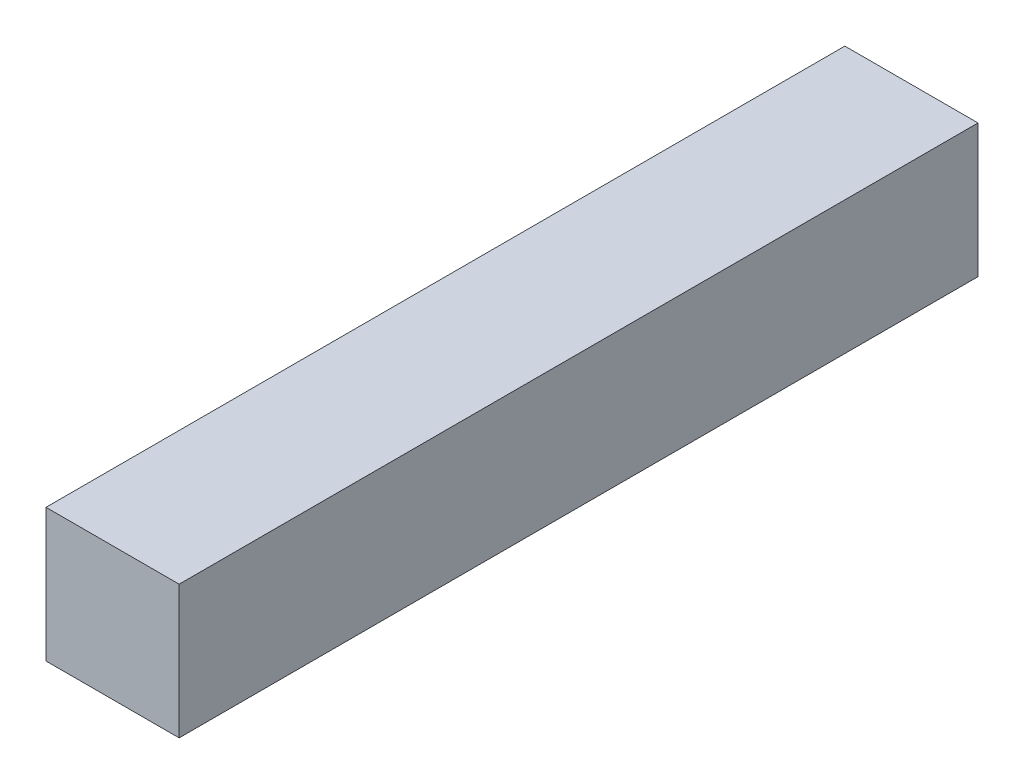
ISO-10303-21;
HEADER;
FILE_DESCRIPTION(('STEP AP214'),'2;1');
FILE_NAME('part.step','',(''),(''),'','','');
FILE_SCHEMA(('AUTOMOTIVE_DESIGN { 1 0 10303 214 1 1 1 1 }'));
ENDSEC;
DATA;
#1=APPLICATION_CONTEXT('core data for automotive mechanical design processes');
#2=APPLICATION_PROTOCOL_DEFINITION('international standard','automotive_design',2000,#1);
#3=PRODUCT_CONTEXT('',#1,'mechanical');
#4=PRODUCT('Part','Part','',(#3));
#5=PRODUCT_RELATED_PRODUCT_CATEGORY('part','',(#4));
#6=PRODUCT_DEFINITION_FORMATION('','',#4);
#7=PRODUCT_DEFINITION_CONTEXT('part definition',#1,'design');
#8=PRODUCT_DEFINITION('design','',#6,#7);
#9=PRODUCT_DEFINITION_SHAPE('','',#8);
#10=(LENGTH_UNIT() NAMED_UNIT(*) SI_UNIT(.MILLI.,.METRE.));
#11=(NAMED_UNIT(*) PLANE_ANGLE_UNIT() SI_UNIT($,.RADIAN.));
#12=(NAMED_UNIT(*) SI_UNIT($,.STERADIAN.) SOLID_ANGLE_UNIT());
#13=UNCERTAINTY_MEASURE_WITH_UNIT(LENGTH_MEASURE(1.E-05),#10,'distance_accuracy_value','');
#14=(GEOMETRIC_REPRESENTATION_CONTEXT(3) GLOBAL_UNCERTAINTY_ASSIGNED_CONTEXT((#13)) GLOBAL_UNIT_ASSIGNED_CONTEXT((#10,
#11,#12)) REPRESENTATION_CONTEXT('',''));
#15=CARTESIAN_POINT('',(0.,0.,0.));
#16=DIRECTION('',(0.,0.,1.));
#17=DIRECTION('',(1.,0.,0.));
#18=AXIS2_PLACEMENT_3D('',#15,#16,#17);
#19=CARTESIAN_POINT('',(-25.,-25.,300.));
#20=DIRECTION('',(1.,0.,0.));
#21=DIRECTION('',(0.,0.,-1.));
#22=AXIS2_PLACEMENT_3D('',#19,#20,#21);
#23=PLANE('',#22);
#24=DIRECTION('',(0.,-1.,0.));
#25=VECTOR('',#24,1.);
#26=CARTESIAN_POINT('',(-25.,-25.,0.));
#27=LINE('',#26,#25);
#28=CARTESIAN_POINT('',(-25.,25.,0.));
#29=VERTEX_POINT('',#28);
#30=CARTESIAN_POINT('',(-25.,-25.,0.));
#31=VERTEX_POINT('',#30);
#32=EDGE_CURVE('E111',#29,#31,#27,.T.);
#33=ORIENTED_EDGE('',*,*,#32,.T.);
#34=DIRECTION('',(0.,0.,-1.));
#35=VECTOR('',#34,1.);
#36=CARTESIAN_POINT('',(-25.,-25.,300.));
#37=LINE('',#36,#35);
#38=CARTESIAN_POINT('',(-25.,-25.,300.));
#39=VERTEX_POINT('',#38);
#40=EDGE_CURVE('E11',#39,#31,#37,.T.);
#41=ORIENTED_EDGE('',*,*,#40,.F.);
#42=DIRECTION('',(0.,-1.,0.));
#43=VECTOR('',#42,1.);
#44=CARTESIAN_POINT('',(-25.,-25.,300.));
#45=LINE('',#44,#43);
#46=CARTESIAN_POINT('',(-25.,25.,300.));
#47=VERTEX_POINT('',#46);
#48=EDGE_CURVE('E95',#47,#39,#45,.T.);
#49=ORIENTED_EDGE('',*,*,#48,.F.);
#50=DIRECTION('',(0.,0.,-1.));
#51=VECTOR('',#50,1.);
#52=CARTESIAN_POINT('',(-25.,25.,300.));
#53=LINE('',#52,#51);
#54=EDGE_CURVE('E107',#47,#29,#53,.T.);
#55=ORIENTED_EDGE('',*,*,#54,.T.);
#56=EDGE_LOOP('',(#33,#41,#49,#55));
#57=FACE_BOUND('',#56,.T.);
#58=ADVANCED_FACE('F43',(#57),#23,.F.);
#59=CARTESIAN_POINT('',(25.,-25.,300.));
#60=DIRECTION('',(0.,1.,0.));
#61=DIRECTION('',(0.,0.,1.));
#62=AXIS2_PLACEMENT_3D('',#59,#60,#61);
#63=PLANE('',#62);
#64=DIRECTION('',(1.,0.,0.));
#65=VECTOR('',#64,1.);
#66=CARTESIAN_POINT('',(25.,-25.,0.));
#67=LINE('',#66,#65);
#68=CARTESIAN_POINT('',(25.,-25.,0.));
#69=VERTEX_POINT('',#68);
#70=EDGE_CURVE('E100',#31,#69,#67,.T.);
#71=ORIENTED_EDGE('',*,*,#70,.T.);
#72=DIRECTION('',(0.,0.,-1.));
#73=VECTOR('',#72,1.);
#74=CARTESIAN_POINT('',(25.,-25.,300.));
#75=LINE('',#74,#73);
#76=CARTESIAN_POINT('',(25.,-25.,300.));
#77=VERTEX_POINT('',#76);
#78=EDGE_CURVE('E52',#77,#69,#75,.T.);
#79=ORIENTED_EDGE('',*,*,#78,.F.);
#80=DIRECTION('',(1.,0.,0.));
#81=VECTOR('',#80,1.);
#82=CARTESIAN_POINT('',(25.,-25.,300.));
#83=LINE('',#82,#81);
#84=EDGE_CURVE('E90',#39,#77,#83,.T.);
#85=ORIENTED_EDGE('',*,*,#84,.F.);
#86=ORIENTED_EDGE('',*,*,#40,.T.);
#87=EDGE_LOOP('',(#71,#79,#85,#86));
#88=FACE_BOUND('',#87,.T.);
#89=ADVANCED_FACE('F99',(#88),#63,.F.);
#90=CARTESIAN_POINT('',(25.,-25.,300.));
#91=DIRECTION('',(-1.,0.,0.));
#92=DIRECTION('',(0.,0.,1.));
#93=AXIS2_PLACEMENT_3D('',#90,#91,#92);
#94=PLANE('',#93);
#95=DIRECTION('',(0.,1.,0.));
#96=VECTOR('',#95,1.);
#97=CARTESIAN_POINT('',(25.,-25.,0.));
#98=LINE('',#97,#96);
#99=CARTESIAN_POINT('',(25.,25.,0.));
#100=VERTEX_POINT('',#99);
#101=EDGE_CURVE('E77',#69,#100,#98,.T.);
#102=ORIENTED_EDGE('',*,*,#101,.T.);
#103=DIRECTION('',(0.,0.,-1.));
#104=VECTOR('',#103,1.);
#105=CARTESIAN_POINT('',(25.,25.,300.));
#106=LINE('',#105,#104);
#107=CARTESIAN_POINT('',(25.,25.,300.));
#108=VERTEX_POINT('',#107);
#109=EDGE_CURVE('E102',#108,#100,#106,.T.);
#110=ORIENTED_EDGE('',*,*,#109,.F.);
#111=DIRECTION('',(0.,1.,0.));
#112=VECTOR('',#111,1.);
#113=CARTESIAN_POINT('',(25.,-25.,300.));
#114=LINE('',#113,#112);
#115=EDGE_CURVE('E93',#77,#108,#114,.T.);
#116=ORIENTED_EDGE('',*,*,#115,.F.);
#117=ORIENTED_EDGE('',*,*,#78,.T.);
#118=EDGE_LOOP('',(#102,#110,#116,#117));
#119=FACE_BOUND('',#118,.T.);
#120=ADVANCED_FACE('F103',(#119),#94,.F.);
#121=CARTESIAN_POINT('',(25.,25.,300.));
#122=DIRECTION('',(0.,-1.,0.));
#123=DIRECTION('',(0.,0.,-1.));
#124=AXIS2_PLACEMENT_3D('',#121,#122,#123);
#125=PLANE('',#124);
#126=DIRECTION('',(-1.,0.,0.));
#127=VECTOR('',#126,1.);
#128=CARTESIAN_POINT('',(25.,25.,0.));
#129=LINE('',#128,#127);
#130=EDGE_CURVE('E83',#100,#29,#129,.T.);
#131=ORIENTED_EDGE('',*,*,#130,.T.);
#132=ORIENTED_EDGE('',*,*,#54,.F.);
#133=DIRECTION('',(-1.,0.,0.));
#134=VECTOR('',#133,1.);
#135=CARTESIAN_POINT('',(25.,25.,300.));
#136=LINE('',#135,#134);
#137=EDGE_CURVE('E60',#108,#47,#136,.T.);
#138=ORIENTED_EDGE('',*,*,#137,.F.);
#139=ORIENTED_EDGE('',*,*,#109,.T.);
#140=EDGE_LOOP('',(#131,#132,#138,#139));
#141=FACE_BOUND('',#140,.T.);
#142=ADVANCED_FACE('F124',(#141),#125,.F.);
#143=CARTESIAN_POINT('',(0.,0.,300.));
#144=DIRECTION('',(0.,0.,1.));
#145=DIRECTION('',(1.,0.,0.));
#146=AXIS2_PLACEMENT_3D('',#143,#144,#145);
#147=PLANE('',#146);
#148=ORIENTED_EDGE('',*,*,#48,.T.);
#149=ORIENTED_EDGE('',*,*,#84,.T.);
#150=ORIENTED_EDGE('',*,*,#115,.T.);
#151=ORIENTED_EDGE('',*,*,#137,.T.);
#152=EDGE_LOOP('',(#148,#149,#150,#151));
#153=FACE_BOUND('',#152,.T.);
#154=ADVANCED_FACE('F91',(#153),#147,.T.);
#155=CARTESIAN_POINT('',(0.,0.,0.));
#156=DIRECTION('',(0.,0.,1.));
#157=DIRECTION('',(1.,0.,0.));
#158=AXIS2_PLACEMENT_3D('',#155,#156,#157);
#159=PLANE('',#158);
#160=ORIENTED_EDGE('',*,*,#32,.F.);
#161=ORIENTED_EDGE('',*,*,#130,.F.);
#162=ORIENTED_EDGE('',*,*,#101,.F.);
#163=ORIENTED_EDGE('',*,*,#70,.F.);
#164=EDGE_LOOP('',(#160,#161,#162,#163));
#165=FACE_BOUND('',#164,.T.);
#166=ADVANCED_FACE('F127',(#165),#159,.F.);
#167=CLOSED_SHELL('',(#58,#89,#120,#142,#154,#166));
#168=MANIFOLD_SOLID_BREP('B2',#167);
#169=ADVANCED_BREP_SHAPE_REPRESENTATION('',(#18,#168),#14);
#170=SHAPE_DEFINITION_REPRESENTATION(#9,#169);
ENDSEC;
END-ISO-10303-21;
